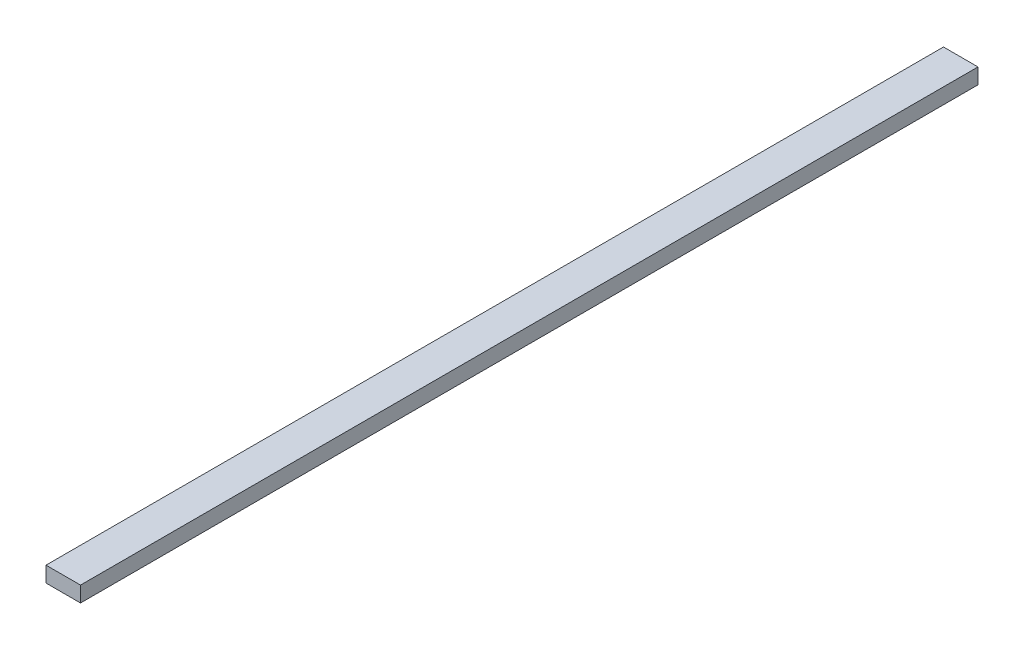
ISO-10303-21;
HEADER;
FILE_DESCRIPTION(('STEP AP214'),'2;1');
FILE_NAME('part.step','',(''),(''),'','','');
FILE_SCHEMA(('AUTOMOTIVE_DESIGN { 1 0 10303 214 1 1 1 1 }'));
ENDSEC;
DATA;
#1=APPLICATION_CONTEXT('core data for automotive mechanical design processes');
#2=APPLICATION_PROTOCOL_DEFINITION('international standard','automotive_design',2000,#1);
#3=PRODUCT_CONTEXT('',#1,'mechanical');
#4=PRODUCT('Part','Part','',(#3));
#5=PRODUCT_RELATED_PRODUCT_CATEGORY('part','',(#4));
#6=PRODUCT_DEFINITION_FORMATION('','',#4);
#7=PRODUCT_DEFINITION_CONTEXT('part definition',#1,'design');
#8=PRODUCT_DEFINITION('design','',#6,#7);
#9=PRODUCT_DEFINITION_SHAPE('','',#8);
#10=(LENGTH_UNIT() NAMED_UNIT(*) SI_UNIT(.MILLI.,.METRE.));
#11=(NAMED_UNIT(*) PLANE_ANGLE_UNIT() SI_UNIT($,.RADIAN.));
#12=(NAMED_UNIT(*) SI_UNIT($,.STERADIAN.) SOLID_ANGLE_UNIT());
#13=UNCERTAINTY_MEASURE_WITH_UNIT(LENGTH_MEASURE(1.E-05),#10,'distance_accuracy_value','');
#14=(GEOMETRIC_REPRESENTATION_CONTEXT(3) GLOBAL_UNCERTAINTY_ASSIGNED_CONTEXT((#13)) GLOBAL_UNIT_ASSIGNED_CONTEXT((#10,
#11,#12)) REPRESENTATION_CONTEXT('',''));
#15=CARTESIAN_POINT('',(0.,0.,0.));
#16=DIRECTION('',(0.,0.,1.));
#17=DIRECTION('',(1.,0.,0.));
#18=AXIS2_PLACEMENT_3D('',#15,#16,#17);
#19=CARTESIAN_POINT('',(-10.0819672131147,1.79508196721311,104.));
#20=DIRECTION('',(1.,0.,0.));
#21=DIRECTION('',(0.,0.,-1.));
#22=AXIS2_PLACEMENT_3D('',#19,#20,#21);
#23=PLANE('',#22);
#24=DIRECTION('',(0.,-1.,0.));
#25=VECTOR('',#24,1.);
#26=CARTESIAN_POINT('',(-10.0819672131147,1.79508196721311,0.));
#27=LINE('',#26,#25);
#28=CARTESIAN_POINT('',(-10.0819672131147,1.79508196721311,0.));
#29=VERTEX_POINT('',#28);
#30=CARTESIAN_POINT('',(-10.0819672131147,-0.00491803278688803,0.));
#31=VERTEX_POINT('',#30);
#32=EDGE_CURVE('E96',#29,#31,#27,.T.);
#33=ORIENTED_EDGE('',*,*,#32,.T.);
#34=DIRECTION('',(0.,0.,-1.));
#35=VECTOR('',#34,1.);
#36=CARTESIAN_POINT('',(-10.0819672131147,-0.00491803278688803,104.));
#37=LINE('',#36,#35);
#38=CARTESIAN_POINT('',(-10.0819672131147,-0.00491803278688803,104.));
#39=VERTEX_POINT('',#38);
#40=EDGE_CURVE('E11',#39,#31,#37,.T.);
#41=ORIENTED_EDGE('',*,*,#40,.F.);
#42=DIRECTION('',(0.,-1.,0.));
#43=VECTOR('',#42,1.);
#44=CARTESIAN_POINT('',(-10.0819672131147,1.79508196721311,104.));
#45=LINE('',#44,#43);
#46=CARTESIAN_POINT('',(-10.0819672131147,1.79508196721311,104.));
#47=VERTEX_POINT('',#46);
#48=EDGE_CURVE('E84',#47,#39,#45,.T.);
#49=ORIENTED_EDGE('',*,*,#48,.F.);
#50=DIRECTION('',(0.,0.,-1.));
#51=VECTOR('',#50,1.);
#52=CARTESIAN_POINT('',(-10.0819672131147,1.79508196721311,104.));
#53=LINE('',#52,#51);
#54=EDGE_CURVE('E92',#47,#29,#53,.T.);
#55=ORIENTED_EDGE('',*,*,#54,.T.);
#56=EDGE_LOOP('',(#33,#41,#49,#55));
#57=FACE_BOUND('',#56,.T.);
#58=ADVANCED_FACE('F33',(#57),#23,.F.);
#59=CARTESIAN_POINT('',(-10.0819672131147,-0.00491803278688803,104.));
#60=DIRECTION('',(0.,1.,0.));
#61=DIRECTION('',(0.,0.,1.));
#62=AXIS2_PLACEMENT_3D('',#59,#60,#61);
#63=PLANE('',#62);
#64=DIRECTION('',(1.,0.,0.));
#65=VECTOR('',#64,1.);
#66=CARTESIAN_POINT('',(-10.0819672131147,-0.00491803278688803,0.));
#67=LINE('',#66,#65);
#68=CARTESIAN_POINT('',(-6.08196721311475,-0.00491803278688803,0.));
#69=VERTEX_POINT('',#68);
#70=EDGE_CURVE('E88',#31,#69,#67,.T.);
#71=ORIENTED_EDGE('',*,*,#70,.T.);
#72=DIRECTION('',(0.,0.,-1.));
#73=VECTOR('',#72,1.);
#74=CARTESIAN_POINT('',(-6.08196721311475,-0.00491803278688803,104.));
#75=LINE('',#74,#73);
#76=CARTESIAN_POINT('',(-6.08196721311475,-0.00491803278688803,104.));
#77=VERTEX_POINT('',#76);
#78=EDGE_CURVE('E41',#77,#69,#75,.T.);
#79=ORIENTED_EDGE('',*,*,#78,.F.);
#80=DIRECTION('',(1.,0.,0.));
#81=VECTOR('',#80,1.);
#82=CARTESIAN_POINT('',(-10.0819672131147,-0.00491803278688803,104.));
#83=LINE('',#82,#81);
#84=EDGE_CURVE('E79',#39,#77,#83,.T.);
#85=ORIENTED_EDGE('',*,*,#84,.F.);
#86=ORIENTED_EDGE('',*,*,#40,.T.);
#87=EDGE_LOOP('',(#71,#79,#85,#86));
#88=FACE_BOUND('',#87,.T.);
#89=ADVANCED_FACE('F87',(#88),#63,.F.);
#90=CARTESIAN_POINT('',(-6.08196721311475,1.79508196721311,104.));
#91=DIRECTION('',(-1.,0.,0.));
#92=DIRECTION('',(0.,0.,1.));
#93=AXIS2_PLACEMENT_3D('',#90,#91,#92);
#94=PLANE('',#93);
#95=DIRECTION('',(0.,1.,0.));
#96=VECTOR('',#95,1.);
#97=CARTESIAN_POINT('',(-6.08196721311475,1.79508196721311,0.));
#98=LINE('',#97,#96);
#99=CARTESIAN_POINT('',(-6.08196721311475,1.79508196721311,0.));
#100=VERTEX_POINT('',#99);
#101=EDGE_CURVE('E66',#69,#100,#98,.T.);
#102=ORIENTED_EDGE('',*,*,#101,.T.);
#103=DIRECTION('',(0.,0.,-1.));
#104=VECTOR('',#103,1.);
#105=CARTESIAN_POINT('',(-6.08196721311475,1.79508196721311,104.));
#106=LINE('',#105,#104);
#107=CARTESIAN_POINT('',(-6.08196721311475,1.79508196721311,104.));
#108=VERTEX_POINT('',#107);
#109=EDGE_CURVE('E89',#108,#100,#106,.T.);
#110=ORIENTED_EDGE('',*,*,#109,.F.);
#111=DIRECTION('',(0.,1.,0.));
#112=VECTOR('',#111,1.);
#113=CARTESIAN_POINT('',(-6.08196721311475,1.79508196721311,104.));
#114=LINE('',#113,#112);
#115=EDGE_CURVE('E82',#77,#108,#114,.T.);
#116=ORIENTED_EDGE('',*,*,#115,.F.);
#117=ORIENTED_EDGE('',*,*,#78,.T.);
#118=EDGE_LOOP('',(#102,#110,#116,#117));
#119=FACE_BOUND('',#118,.T.);
#120=ADVANCED_FACE('F90',(#119),#94,.F.);
#121=CARTESIAN_POINT('',(-10.0819672131147,1.79508196721311,104.));
#122=DIRECTION('',(0.,-1.,0.));
#123=DIRECTION('',(0.,0.,-1.));
#124=AXIS2_PLACEMENT_3D('',#121,#122,#123);
#125=PLANE('',#124);
#126=DIRECTION('',(-1.,0.,0.));
#127=VECTOR('',#126,1.);
#128=CARTESIAN_POINT('',(-10.0819672131147,1.79508196721311,0.));
#129=LINE('',#128,#127);
#130=EDGE_CURVE('E72',#100,#29,#129,.T.);
#131=ORIENTED_EDGE('',*,*,#130,.T.);
#132=ORIENTED_EDGE('',*,*,#54,.F.);
#133=DIRECTION('',(-1.,0.,0.));
#134=VECTOR('',#133,1.);
#135=CARTESIAN_POINT('',(-10.0819672131147,1.79508196721311,104.));
#136=LINE('',#135,#134);
#137=EDGE_CURVE('E49',#108,#47,#136,.T.);
#138=ORIENTED_EDGE('',*,*,#137,.F.);
#139=ORIENTED_EDGE('',*,*,#109,.T.);
#140=EDGE_LOOP('',(#131,#132,#138,#139));
#141=FACE_BOUND('',#140,.T.);
#142=ADVANCED_FACE('F103',(#141),#125,.F.);
#143=CARTESIAN_POINT('',(0.,0.,104.));
#144=DIRECTION('',(0.,0.,1.));
#145=DIRECTION('',(1.,0.,0.));
#146=AXIS2_PLACEMENT_3D('',#143,#144,#145);
#147=PLANE('',#146);
#148=ORIENTED_EDGE('',*,*,#48,.T.);
#149=ORIENTED_EDGE('',*,*,#84,.T.);
#150=ORIENTED_EDGE('',*,*,#115,.T.);
#151=ORIENTED_EDGE('',*,*,#137,.T.);
#152=EDGE_LOOP('',(#148,#149,#150,#151));
#153=FACE_BOUND('',#152,.T.);
#154=ADVANCED_FACE('F80',(#153),#147,.T.);
#155=CARTESIAN_POINT('',(0.,0.,0.));
#156=DIRECTION('',(0.,0.,1.));
#157=DIRECTION('',(1.,0.,0.));
#158=AXIS2_PLACEMENT_3D('',#155,#156,#157);
#159=PLANE('',#158);
#160=ORIENTED_EDGE('',*,*,#32,.F.);
#161=ORIENTED_EDGE('',*,*,#130,.F.);
#162=ORIENTED_EDGE('',*,*,#101,.F.);
#163=ORIENTED_EDGE('',*,*,#70,.F.);
#164=EDGE_LOOP('',(#160,#161,#162,#163));
#165=FACE_BOUND('',#164,.T.);
#166=ADVANCED_FACE('F106',(#165),#159,.F.);
#167=CLOSED_SHELL('',(#58,#89,#120,#142,#154,#166));
#168=MANIFOLD_SOLID_BREP('B2',#167);
#169=ADVANCED_BREP_SHAPE_REPRESENTATION('',(#18,#168),#14);
#170=SHAPE_DEFINITION_REPRESENTATION(#9,#169);
ENDSEC;
END-ISO-10303-21;
